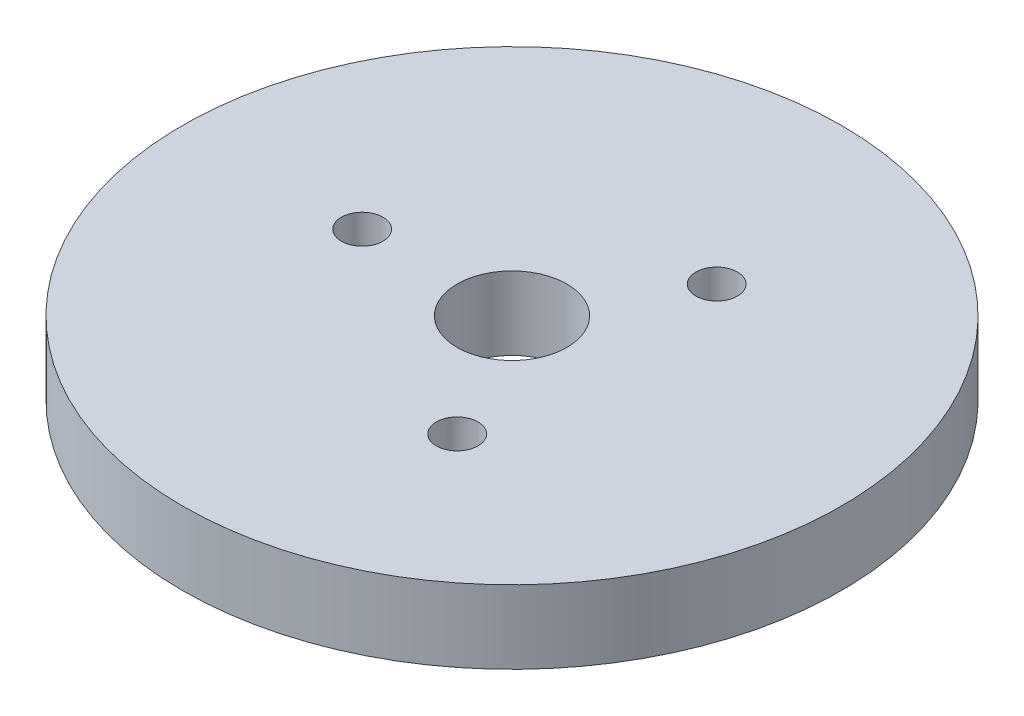
ISO-10303-21;
HEADER;
FILE_DESCRIPTION(('STEP AP214'),'2;1');
FILE_NAME('part.step','',(''),(''),'','','');
FILE_SCHEMA(('AUTOMOTIVE_DESIGN { 1 0 10303 214 1 1 1 1 }'));
ENDSEC;
DATA;
#1=APPLICATION_CONTEXT('core data for automotive mechanical design processes');
#2=APPLICATION_PROTOCOL_DEFINITION('international standard','automotive_design',2000,#1);
#3=PRODUCT_CONTEXT('',#1,'mechanical');
#4=PRODUCT('Part','Part','',(#3));
#5=PRODUCT_RELATED_PRODUCT_CATEGORY('part','',(#4));
#6=PRODUCT_DEFINITION_FORMATION('','',#4);
#7=PRODUCT_DEFINITION_CONTEXT('part definition',#1,'design');
#8=PRODUCT_DEFINITION('design','',#6,#7);
#9=PRODUCT_DEFINITION_SHAPE('','',#8);
#10=(LENGTH_UNIT() NAMED_UNIT(*) SI_UNIT(.MILLI.,.METRE.));
#11=(NAMED_UNIT(*) PLANE_ANGLE_UNIT() SI_UNIT($,.RADIAN.));
#12=(NAMED_UNIT(*) SI_UNIT($,.STERADIAN.) SOLID_ANGLE_UNIT());
#13=UNCERTAINTY_MEASURE_WITH_UNIT(LENGTH_MEASURE(1.E-05),#10,'distance_accuracy_value','');
#14=(GEOMETRIC_REPRESENTATION_CONTEXT(3) GLOBAL_UNCERTAINTY_ASSIGNED_CONTEXT((#13)) GLOBAL_UNIT_ASSIGNED_CONTEXT((#10,
#11,#12)) REPRESENTATION_CONTEXT('',''));
#15=CARTESIAN_POINT('',(0.,0.,0.));
#16=DIRECTION('',(0.,0.,1.));
#17=DIRECTION('',(1.,0.,0.));
#18=AXIS2_PLACEMENT_3D('',#15,#16,#17);
#19=CARTESIAN_POINT('',(0.,20.,0.));
#20=DIRECTION('',(0.,-1.,0.));
#21=DIRECTION('',(0.,0.,-1.));
#22=AXIS2_PLACEMENT_3D('',#19,#20,#21);
#23=CYLINDRICAL_SURFACE('',#22,90.);
#24=CARTESIAN_POINT('',(0.,20.,0.));
#25=DIRECTION('',(0.,1.,0.));
#26=DIRECTION('',(0.,0.,1.));
#27=AXIS2_PLACEMENT_3D('',#24,#25,#26);
#28=CIRCLE('',#27,90.);
#29=CARTESIAN_POINT('',(0.,20.,90.));
#30=VERTEX_POINT('',#29);
#31=EDGE_CURVE('E10',#30,#30,#28,.T.);
#32=ORIENTED_EDGE('',*,*,#31,.F.);
#33=EDGE_LOOP('',(#32));
#34=FACE_BOUND('',#33,.T.);
#35=CARTESIAN_POINT('',(0.,0.,0.));
#36=DIRECTION('',(0.,1.,0.));
#37=DIRECTION('',(0.,0.,1.));
#38=AXIS2_PLACEMENT_3D('',#35,#36,#37);
#39=CIRCLE('',#38,90.);
#40=CARTESIAN_POINT('',(0.,0.,90.));
#41=VERTEX_POINT('',#40);
#42=EDGE_CURVE('E37',#41,#41,#39,.T.);
#43=ORIENTED_EDGE('',*,*,#42,.T.);
#44=EDGE_LOOP('',(#43));
#45=FACE_BOUND('',#44,.T.);
#46=ADVANCED_FACE('F40',(#34,#45),#23,.T.);
#47=CARTESIAN_POINT('',(0.,20.,0.));
#48=DIRECTION('',(0.,1.,0.));
#49=DIRECTION('',(0.,0.,1.));
#50=AXIS2_PLACEMENT_3D('',#47,#48,#49);
#51=PLANE('',#50);
#52=CARTESIAN_POINT('',(20.4612847701889,20.,35.439984810102));
#53=DIRECTION('',(0.,1.,0.));
#54=DIRECTION('',(0.866025403784436,0.,-0.500000000000004));
#55=AXIS2_PLACEMENT_3D('',#52,#53,#54);
#56=CIRCLE('',#55,5.68548147556628);
#57=CARTESIAN_POINT('',(25.3850561607751,20.,32.5972440723189));
#58=VERTEX_POINT('',#57);
#59=EDGE_CURVE('E70',#58,#58,#56,.T.);
#60=ORIENTED_EDGE('',*,*,#59,.F.);
#61=EDGE_LOOP('',(#60));
#62=FACE_BOUND('',#61,.T.);
#63=CARTESIAN_POINT('',(20.4612847701884,20.,-35.4399848101023));
#64=DIRECTION('',(0.,1.,0.));
#65=DIRECTION('',(-0.866025403784443,0.,-0.499999999999992));
#66=AXIS2_PLACEMENT_3D('',#63,#64,#65);
#67=CIRCLE('',#66,5.68548147556628);
#68=CARTESIAN_POINT('',(15.5375133796021,20.,-38.2827255478854));
#69=VERTEX_POINT('',#68);
#70=EDGE_CURVE('E61',#69,#69,#67,.T.);
#71=ORIENTED_EDGE('',*,*,#70,.F.);
#72=EDGE_LOOP('',(#71));
#73=FACE_BOUND('',#72,.T.);
#74=CARTESIAN_POINT('',(-40.9225695403774,20.,0.));
#75=DIRECTION('',(0.,1.,0.));
#76=DIRECTION('',(0.,0.,1.));
#77=AXIS2_PLACEMENT_3D('',#74,#75,#76);
#78=CIRCLE('',#77,5.68548147556628);
#79=CARTESIAN_POINT('',(-40.9225695403774,20.,5.68548147556628));
#80=VERTEX_POINT('',#79);
#81=EDGE_CURVE('E54',#80,#80,#78,.T.);
#82=ORIENTED_EDGE('',*,*,#81,.F.);
#83=EDGE_LOOP('',(#82));
#84=FACE_BOUND('',#83,.T.);
#85=CARTESIAN_POINT('',(0.,20.,0.));
#86=DIRECTION('',(0.,1.,0.));
#87=DIRECTION('',(0.,0.,1.));
#88=AXIS2_PLACEMENT_3D('',#85,#86,#87);
#89=CIRCLE('',#88,15.);
#90=CARTESIAN_POINT('',(0.,20.,15.));
#91=VERTEX_POINT('',#90);
#92=EDGE_CURVE('E50',#91,#91,#89,.T.);
#93=ORIENTED_EDGE('',*,*,#92,.F.);
#94=EDGE_LOOP('',(#93));
#95=FACE_BOUND('',#94,.T.);
#96=ORIENTED_EDGE('',*,*,#31,.T.);
#97=EDGE_LOOP('',(#96));
#98=FACE_BOUND('',#97,.T.);
#99=ADVANCED_FACE('F85',(#62,#73,#84,#95,#98),#51,.T.);
#100=CARTESIAN_POINT('',(0.,0.,0.));
#101=DIRECTION('',(0.,1.,0.));
#102=DIRECTION('',(0.,0.,1.));
#103=AXIS2_PLACEMENT_3D('',#100,#101,#102);
#104=PLANE('',#103);
#105=CARTESIAN_POINT('',(0.,0.,0.));
#106=DIRECTION('',(0.,1.,0.));
#107=DIRECTION('',(0.,0.,1.));
#108=AXIS2_PLACEMENT_3D('',#105,#106,#107);
#109=CIRCLE('',#108,15.);
#110=CARTESIAN_POINT('',(0.,0.,15.));
#111=VERTEX_POINT('',#110);
#112=EDGE_CURVE('E47',#111,#111,#109,.T.);
#113=ORIENTED_EDGE('',*,*,#112,.T.);
#114=EDGE_LOOP('',(#113));
#115=FACE_BOUND('',#114,.T.);
#116=ORIENTED_EDGE('',*,*,#42,.F.);
#117=EDGE_LOOP('',(#116));
#118=FACE_BOUND('',#117,.T.);
#119=ADVANCED_FACE('F84',(#115,#118),#104,.F.);
#120=CARTESIAN_POINT('',(0.,20.,0.));
#121=DIRECTION('',(0.,-1.,0.));
#122=DIRECTION('',(0.,0.,-1.));
#123=AXIS2_PLACEMENT_3D('',#120,#121,#122);
#124=CYLINDRICAL_SURFACE('',#123,15.);
#125=ORIENTED_EDGE('',*,*,#92,.T.);
#126=EDGE_LOOP('',(#125));
#127=FACE_BOUND('',#126,.T.);
#128=ORIENTED_EDGE('',*,*,#112,.F.);
#129=EDGE_LOOP('',(#128));
#130=FACE_BOUND('',#129,.T.);
#131=ADVANCED_FACE('F91',(#127,#130),#124,.F.);
#132=CARTESIAN_POINT('',(-40.9225695403774,1.911742116685,0.));
#133=DIRECTION('',(0.,1.,0.));
#134=DIRECTION('',(0.,0.,1.));
#135=AXIS2_PLACEMENT_3D('',#132,#133,#134);
#136=CYLINDRICAL_SURFACE('',#135,5.68548147556628);
#137=CARTESIAN_POINT('',(-40.9225695403774,1.911742116685,0.));
#138=DIRECTION('',(0.,1.,0.));
#139=DIRECTION('',(0.,0.,1.));
#140=AXIS2_PLACEMENT_3D('',#137,#138,#139);
#141=CIRCLE('',#140,5.68548147556628);
#142=CARTESIAN_POINT('',(-40.9225695403774,1.911742116685,5.68548147556628));
#143=VERTEX_POINT('',#142);
#144=EDGE_CURVE('E55',#143,#143,#141,.T.);
#145=ORIENTED_EDGE('',*,*,#144,.F.);
#146=EDGE_LOOP('',(#145));
#147=FACE_BOUND('',#146,.T.);
#148=ORIENTED_EDGE('',*,*,#81,.T.);
#149=EDGE_LOOP('',(#148));
#150=FACE_BOUND('',#149,.T.);
#151=ADVANCED_FACE('F96',(#147,#150),#136,.F.);
#152=CARTESIAN_POINT('',(-40.9225695403774,1.911742116685,0.));
#153=DIRECTION('',(0.,1.,0.));
#154=DIRECTION('',(0.,0.,1.));
#155=AXIS2_PLACEMENT_3D('',#152,#153,#154);
#156=PLANE('',#155);
#157=ORIENTED_EDGE('',*,*,#144,.T.);
#158=EDGE_LOOP('',(#157));
#159=FACE_BOUND('',#158,.T.);
#160=ADVANCED_FACE('F127',(#159),#156,.T.);
#161=CARTESIAN_POINT('',(20.4612847701884,1.911742116685,-35.4399848101023));
#162=DIRECTION('',(0.,1.,0.));
#163=DIRECTION('',(0.,0.,1.));
#164=AXIS2_PLACEMENT_3D('',#161,#162,#163);
#165=CYLINDRICAL_SURFACE('',#164,5.68548147556628);
#166=CARTESIAN_POINT('',(20.4612847701884,1.911742116685,-35.4399848101023));
#167=DIRECTION('',(0.,1.,0.));
#168=DIRECTION('',(-0.866025403784443,0.,-0.499999999999992));
#169=AXIS2_PLACEMENT_3D('',#166,#167,#168);
#170=CIRCLE('',#169,5.68548147556628);
#171=CARTESIAN_POINT('',(15.5375133796021,1.911742116685,-38.2827255478854));
#172=VERTEX_POINT('',#171);
#173=EDGE_CURVE('E63',#172,#172,#170,.T.);
#174=ORIENTED_EDGE('',*,*,#173,.F.);
#175=EDGE_LOOP('',(#174));
#176=FACE_BOUND('',#175,.T.);
#177=ORIENTED_EDGE('',*,*,#70,.T.);
#178=EDGE_LOOP('',(#177));
#179=FACE_BOUND('',#178,.T.);
#180=ADVANCED_FACE('F133',(#176,#179),#165,.F.);
#181=CARTESIAN_POINT('',(20.4612847701884,1.911742116685,-35.4399848101023));
#182=DIRECTION('',(0.,1.,0.));
#183=DIRECTION('',(-0.866025403784443,0.,-0.499999999999992));
#184=AXIS2_PLACEMENT_3D('',#181,#182,#183);
#185=PLANE('',#184);
#186=ORIENTED_EDGE('',*,*,#173,.T.);
#187=EDGE_LOOP('',(#186));
#188=FACE_BOUND('',#187,.T.);
#189=ADVANCED_FACE('F77',(#188),#185,.T.);
#190=CARTESIAN_POINT('',(20.4612847701889,1.911742116685,35.439984810102));
#191=DIRECTION('',(0.,1.,0.));
#192=DIRECTION('',(0.,0.,1.));
#193=AXIS2_PLACEMENT_3D('',#190,#191,#192);
#194=CYLINDRICAL_SURFACE('',#193,5.68548147556628);
#195=CARTESIAN_POINT('',(20.4612847701889,1.911742116685,35.439984810102));
#196=DIRECTION('',(0.,1.,0.));
#197=DIRECTION('',(0.866025403784436,0.,-0.500000000000004));
#198=AXIS2_PLACEMENT_3D('',#195,#196,#197);
#199=CIRCLE('',#198,5.68548147556628);
#200=CARTESIAN_POINT('',(25.3850561607751,1.911742116685,32.5972440723189));
#201=VERTEX_POINT('',#200);
#202=EDGE_CURVE('E59',#201,#201,#199,.T.);
#203=ORIENTED_EDGE('',*,*,#202,.F.);
#204=EDGE_LOOP('',(#203));
#205=FACE_BOUND('',#204,.T.);
#206=ORIENTED_EDGE('',*,*,#59,.T.);
#207=EDGE_LOOP('',(#206));
#208=FACE_BOUND('',#207,.T.);
#209=ADVANCED_FACE('F73',(#205,#208),#194,.F.);
#210=CARTESIAN_POINT('',(20.4612847701889,1.911742116685,35.439984810102));
#211=DIRECTION('',(0.,1.,0.));
#212=DIRECTION('',(0.866025403784436,0.,-0.500000000000004));
#213=AXIS2_PLACEMENT_3D('',#210,#211,#212);
#214=PLANE('',#213);
#215=ORIENTED_EDGE('',*,*,#202,.T.);
#216=EDGE_LOOP('',(#215));
#217=FACE_BOUND('',#216,.T.);
#218=ADVANCED_FACE('F71',(#217),#214,.T.);
#219=CLOSED_SHELL('',(#46,#99,#119,#131,#151,#160,#180,#189,#209,#218));
#220=MANIFOLD_SOLID_BREP('B2',#219);
#221=ADVANCED_BREP_SHAPE_REPRESENTATION('',(#18,#220),#14);
#222=SHAPE_DEFINITION_REPRESENTATION(#9,#221);
ENDSEC;
END-ISO-10303-21;
